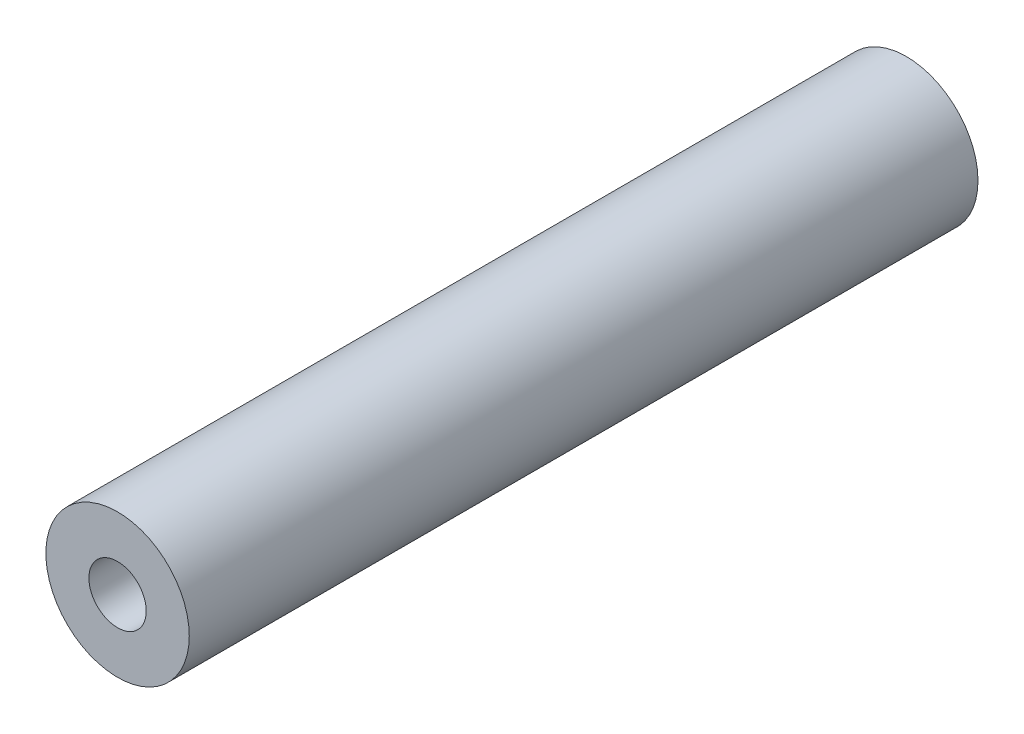
ISO-10303-21;
HEADER;
FILE_DESCRIPTION(('STEP AP214'),'2;1');
FILE_NAME('part.step','',(''),(''),'','','');
FILE_SCHEMA(('AUTOMOTIVE_DESIGN { 1 0 10303 214 1 1 1 1 }'));
ENDSEC;
DATA;
#1=APPLICATION_CONTEXT('core data for automotive mechanical design processes');
#2=APPLICATION_PROTOCOL_DEFINITION('international standard','automotive_design',2000,#1);
#3=PRODUCT_CONTEXT('',#1,'mechanical');
#4=PRODUCT('Part','Part','',(#3));
#5=PRODUCT_RELATED_PRODUCT_CATEGORY('part','',(#4));
#6=PRODUCT_DEFINITION_FORMATION('','',#4);
#7=PRODUCT_DEFINITION_CONTEXT('part definition',#1,'design');
#8=PRODUCT_DEFINITION('design','',#6,#7);
#9=PRODUCT_DEFINITION_SHAPE('','',#8);
#10=(LENGTH_UNIT() NAMED_UNIT(*) SI_UNIT(.MILLI.,.METRE.));
#11=(NAMED_UNIT(*) PLANE_ANGLE_UNIT() SI_UNIT($,.RADIAN.));
#12=(NAMED_UNIT(*) SI_UNIT($,.STERADIAN.) SOLID_ANGLE_UNIT());
#13=UNCERTAINTY_MEASURE_WITH_UNIT(LENGTH_MEASURE(1.E-05),#10,'distance_accuracy_value','');
#14=(GEOMETRIC_REPRESENTATION_CONTEXT(3) GLOBAL_UNCERTAINTY_ASSIGNED_CONTEXT((#13)) GLOBAL_UNIT_ASSIGNED_CONTEXT((#10,
#11,#12)) REPRESENTATION_CONTEXT('',''));
#15=CARTESIAN_POINT('',(0.,0.,0.));
#16=DIRECTION('',(0.,0.,1.));
#17=DIRECTION('',(1.,0.,0.));
#18=AXIS2_PLACEMENT_3D('',#15,#16,#17);
#19=CARTESIAN_POINT('',(0.,-65.,55.));
#20=DIRECTION('',(0.,0.,1.));
#21=DIRECTION('',(1.,0.,0.));
#22=AXIS2_PLACEMENT_3D('',#19,#20,#21);
#23=PLANE('',#22);
#24=CARTESIAN_POINT('',(0.,-65.,55.));
#25=DIRECTION('',(0.,0.,1.));
#26=DIRECTION('',(1.,0.,0.));
#27=AXIS2_PLACEMENT_3D('',#24,#25,#26);
#28=CIRCLE('',#27,5.00000000000001);
#29=CARTESIAN_POINT('',(5.00000000000001,-65.,55.));
#30=VERTEX_POINT('',#29);
#31=EDGE_CURVE('E10',#30,#30,#28,.T.);
#32=ORIENTED_EDGE('',*,*,#31,.T.);
#33=EDGE_LOOP('',(#32));
#34=FACE_BOUND('',#33,.T.);
#35=CARTESIAN_POINT('',(0.,-65.,55.));
#36=DIRECTION('',(0.,0.,1.));
#37=DIRECTION('',(1.,0.,0.));
#38=AXIS2_PLACEMENT_3D('',#35,#36,#37);
#39=CIRCLE('',#38,2.);
#40=CARTESIAN_POINT('',(2.00000000000001,-65.,55.));
#41=VERTEX_POINT('',#40);
#42=EDGE_CURVE('E39',#41,#41,#39,.T.);
#43=ORIENTED_EDGE('',*,*,#42,.F.);
#44=EDGE_LOOP('',(#43));
#45=FACE_BOUND('',#44,.T.);
#46=ADVANCED_FACE('F28',(#34,#45),#23,.T.);
#47=CARTESIAN_POINT('',(0.,-65.,0.));
#48=DIRECTION('',(0.,0.,1.));
#49=DIRECTION('',(1.,0.,0.));
#50=AXIS2_PLACEMENT_3D('',#47,#48,#49);
#51=PLANE('',#50);
#52=CARTESIAN_POINT('',(0.,-65.,0.));
#53=DIRECTION('',(0.,0.,1.));
#54=DIRECTION('',(1.,0.,0.));
#55=AXIS2_PLACEMENT_3D('',#52,#53,#54);
#56=CIRCLE('',#55,5.00000000000001);
#57=CARTESIAN_POINT('',(5.00000000000001,-65.,0.));
#58=VERTEX_POINT('',#57);
#59=EDGE_CURVE('E32',#58,#58,#56,.T.);
#60=ORIENTED_EDGE('',*,*,#59,.F.);
#61=EDGE_LOOP('',(#60));
#62=FACE_BOUND('',#61,.T.);
#63=CARTESIAN_POINT('',(0.,-65.,0.));
#64=DIRECTION('',(0.,0.,1.));
#65=DIRECTION('',(1.,0.,0.));
#66=AXIS2_PLACEMENT_3D('',#63,#64,#65);
#67=CIRCLE('',#66,2.);
#68=CARTESIAN_POINT('',(2.00000000000001,-65.,0.));
#69=VERTEX_POINT('',#68);
#70=EDGE_CURVE('E41',#69,#69,#67,.T.);
#71=ORIENTED_EDGE('',*,*,#70,.T.);
#72=EDGE_LOOP('',(#71));
#73=FACE_BOUND('',#72,.T.);
#74=ADVANCED_FACE('F51',(#62,#73),#51,.F.);
#75=CARTESIAN_POINT('',(0.,-65.,55.));
#76=DIRECTION('',(0.,0.,-1.));
#77=DIRECTION('',(-1.,0.,0.));
#78=AXIS2_PLACEMENT_3D('',#75,#76,#77);
#79=CYLINDRICAL_SURFACE('',#78,5.00000000000001);
#80=ORIENTED_EDGE('',*,*,#31,.F.);
#81=EDGE_LOOP('',(#80));
#82=FACE_BOUND('',#81,.T.);
#83=ORIENTED_EDGE('',*,*,#59,.T.);
#84=EDGE_LOOP('',(#83));
#85=FACE_BOUND('',#84,.T.);
#86=ADVANCED_FACE('F30',(#82,#85),#79,.T.);
#87=CARTESIAN_POINT('',(0.,-65.,55.));
#88=DIRECTION('',(0.,0.,-1.));
#89=DIRECTION('',(-1.,0.,0.));
#90=AXIS2_PLACEMENT_3D('',#87,#88,#89);
#91=CYLINDRICAL_SURFACE('',#90,2.);
#92=ORIENTED_EDGE('',*,*,#42,.T.);
#93=EDGE_LOOP('',(#92));
#94=FACE_BOUND('',#93,.T.);
#95=ORIENTED_EDGE('',*,*,#70,.F.);
#96=EDGE_LOOP('',(#95));
#97=FACE_BOUND('',#96,.T.);
#98=ADVANCED_FACE('F47',(#94,#97),#91,.F.);
#99=CLOSED_SHELL('',(#46,#74,#86,#98));
#100=MANIFOLD_SOLID_BREP('B2',#99);
#101=ADVANCED_BREP_SHAPE_REPRESENTATION('',(#18,#100),#14);
#102=SHAPE_DEFINITION_REPRESENTATION(#9,#101);
ENDSEC;
END-ISO-10303-21;
